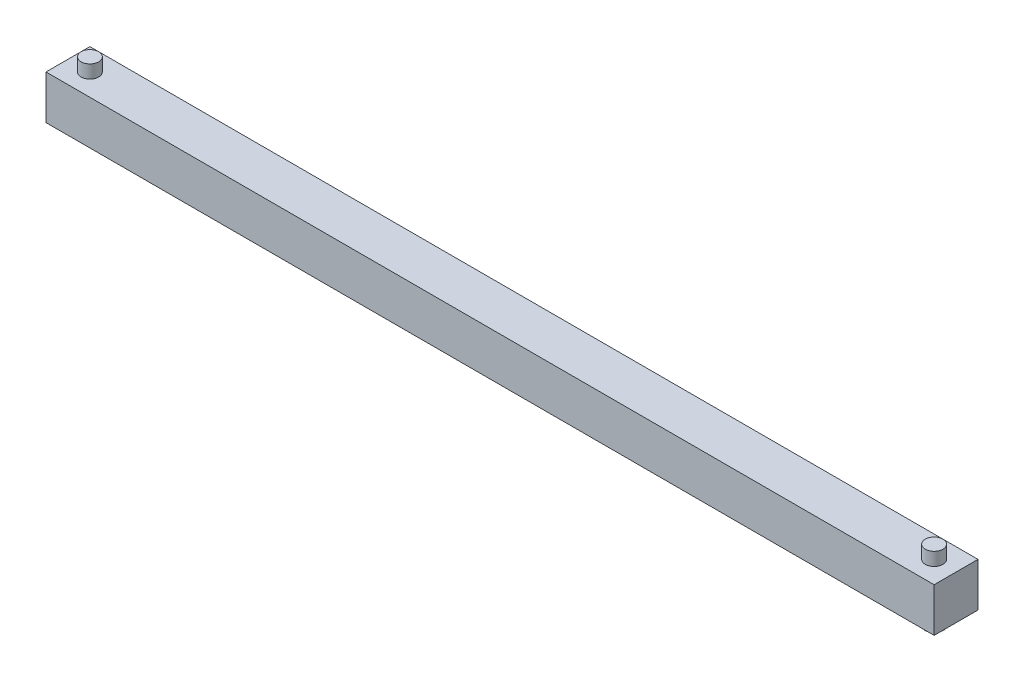
ISO-10303-21;
HEADER;
FILE_DESCRIPTION(('STEP AP214'),'2;1');
FILE_NAME('part.step','',(''),(''),'','','');
FILE_SCHEMA(('AUTOMOTIVE_DESIGN { 1 0 10303 214 1 1 1 1 }'));
ENDSEC;
DATA;
#1=APPLICATION_CONTEXT('core data for automotive mechanical design processes');
#2=APPLICATION_PROTOCOL_DEFINITION('international standard','automotive_design',2000,#1);
#3=PRODUCT_CONTEXT('',#1,'mechanical');
#4=PRODUCT('Part','Part','',(#3));
#5=PRODUCT_RELATED_PRODUCT_CATEGORY('part','',(#4));
#6=PRODUCT_DEFINITION_FORMATION('','',#4);
#7=PRODUCT_DEFINITION_CONTEXT('part definition',#1,'design');
#8=PRODUCT_DEFINITION('design','',#6,#7);
#9=PRODUCT_DEFINITION_SHAPE('','',#8);
#10=(LENGTH_UNIT() NAMED_UNIT(*) SI_UNIT(.MILLI.,.METRE.));
#11=(NAMED_UNIT(*) PLANE_ANGLE_UNIT() SI_UNIT($,.RADIAN.));
#12=(NAMED_UNIT(*) SI_UNIT($,.STERADIAN.) SOLID_ANGLE_UNIT());
#13=UNCERTAINTY_MEASURE_WITH_UNIT(LENGTH_MEASURE(1.E-05),#10,'distance_accuracy_value','');
#14=(GEOMETRIC_REPRESENTATION_CONTEXT(3) GLOBAL_UNCERTAINTY_ASSIGNED_CONTEXT((#13)) GLOBAL_UNIT_ASSIGNED_CONTEXT((#10,
#11,#12)) REPRESENTATION_CONTEXT('',''));
#15=CARTESIAN_POINT('',(0.,0.,0.));
#16=DIRECTION('',(0.,0.,1.));
#17=DIRECTION('',(1.,0.,0.));
#18=AXIS2_PLACEMENT_3D('',#15,#16,#17);
#19=CARTESIAN_POINT('',(-96.5829836274042,0.,8.));
#20=DIRECTION('',(1.,0.,0.));
#21=DIRECTION('',(0.,0.,-1.));
#22=AXIS2_PLACEMENT_3D('',#19,#20,#21);
#23=PLANE('',#22);
#24=DIRECTION('',(0.,-1.,0.));
#25=VECTOR('',#24,1.);
#26=CARTESIAN_POINT('',(-96.5829836274042,0.,0.));
#27=LINE('',#26,#25);
#28=CARTESIAN_POINT('',(-96.5829836274042,-5.31358607534573,0.));
#29=VERTEX_POINT('',#28);
#30=CARTESIAN_POINT('',(-96.5829836274042,-13.3135860753457,0.));
#31=VERTEX_POINT('',#30);
#32=EDGE_CURVE('E113',#29,#31,#27,.T.);
#33=ORIENTED_EDGE('',*,*,#32,.T.);
#34=DIRECTION('',(0.,0.,-1.));
#35=VECTOR('',#34,1.);
#36=CARTESIAN_POINT('',(-96.5829836274042,-13.3135860753457,8.));
#37=LINE('',#36,#35);
#38=CARTESIAN_POINT('',(-96.5829836274042,-13.3135860753457,8.));
#39=VERTEX_POINT('',#38);
#40=EDGE_CURVE('E102',#39,#31,#37,.T.);
#41=ORIENTED_EDGE('',*,*,#40,.F.);
#42=DIRECTION('',(0.,-1.,0.));
#43=VECTOR('',#42,1.);
#44=CARTESIAN_POINT('',(-96.5829836274042,0.,8.));
#45=LINE('',#44,#43);
#46=CARTESIAN_POINT('',(-96.5829836274042,-5.31358607534573,8.));
#47=VERTEX_POINT('',#46);
#48=EDGE_CURVE('E94',#47,#39,#45,.T.);
#49=ORIENTED_EDGE('',*,*,#48,.F.);
#50=DIRECTION('',(0.,0.,-1.));
#51=VECTOR('',#50,1.);
#52=CARTESIAN_POINT('',(-96.5829836274042,-5.31358607534573,8.));
#53=LINE('',#52,#51);
#54=EDGE_CURVE('E109',#47,#29,#53,.T.);
#55=ORIENTED_EDGE('',*,*,#54,.T.);
#56=EDGE_LOOP('',(#33,#41,#49,#55));
#57=FACE_BOUND('',#56,.T.);
#58=ADVANCED_FACE('F41',(#57),#23,.F.);
#59=CARTESIAN_POINT('',(0.,-13.3135860753457,8.));
#60=DIRECTION('',(0.,1.,0.));
#61=DIRECTION('',(0.,0.,1.));
#62=AXIS2_PLACEMENT_3D('',#59,#60,#61);
#63=PLANE('',#62);
#64=CARTESIAN_POINT('',(61.2686643725958,-13.3135860753457,4.00000000000002));
#65=DIRECTION('',(0.,1.,0.));
#66=DIRECTION('',(0.,0.,1.));
#67=AXIS2_PLACEMENT_3D('',#64,#65,#66);
#68=CIRCLE('',#67,1.65000000000001);
#69=CARTESIAN_POINT('',(61.2686643725958,-13.3135860753457,5.65000000000003));
#70=VERTEX_POINT('',#69);
#71=EDGE_CURVE('E11',#70,#70,#68,.F.);
#72=ORIENTED_EDGE('',*,*,#71,.F.);
#73=EDGE_LOOP('',(#72));
#74=FACE_BOUND('',#73,.T.);
#75=CARTESIAN_POINT('',(-92.5829836274042,-13.3135860753457,4.));
#76=DIRECTION('',(0.,1.,0.));
#77=DIRECTION('',(0.,0.,1.));
#78=AXIS2_PLACEMENT_3D('',#75,#76,#77);
#79=CIRCLE('',#78,1.60000000000001);
#80=CARTESIAN_POINT('',(-92.5829836274042,-13.3135860753457,5.60000000000001));
#81=VERTEX_POINT('',#80);
#82=EDGE_CURVE('E50',#81,#81,#79,.F.);
#83=ORIENTED_EDGE('',*,*,#82,.F.);
#84=EDGE_LOOP('',(#83));
#85=FACE_BOUND('',#84,.T.);
#86=DIRECTION('',(1.,0.,0.));
#87=VECTOR('',#86,1.);
#88=CARTESIAN_POINT('',(0.,-13.3135860753457,0.));
#89=LINE('',#88,#87);
#90=CARTESIAN_POINT('',(65.2686643725958,-13.3135860753457,0.));
#91=VERTEX_POINT('',#90);
#92=EDGE_CURVE('E100',#31,#91,#89,.T.);
#93=ORIENTED_EDGE('',*,*,#92,.T.);
#94=DIRECTION('',(0.,0.,-1.));
#95=VECTOR('',#94,1.);
#96=CARTESIAN_POINT('',(65.2686643725958,-13.3135860753457,8.));
#97=LINE('',#96,#95);
#98=CARTESIAN_POINT('',(65.2686643725958,-13.3135860753457,8.));
#99=VERTEX_POINT('',#98);
#100=EDGE_CURVE('E98',#99,#91,#97,.T.);
#101=ORIENTED_EDGE('',*,*,#100,.F.);
#102=DIRECTION('',(1.,0.,0.));
#103=VECTOR('',#102,1.);
#104=CARTESIAN_POINT('',(0.,-13.3135860753457,8.));
#105=LINE('',#104,#103);
#106=EDGE_CURVE('E89',#39,#99,#105,.T.);
#107=ORIENTED_EDGE('',*,*,#106,.F.);
#108=ORIENTED_EDGE('',*,*,#40,.T.);
#109=EDGE_LOOP('',(#93,#101,#107,#108));
#110=FACE_BOUND('',#109,.T.);
#111=ADVANCED_FACE('F99',(#74,#85,#110),#63,.F.);
#112=CARTESIAN_POINT('',(65.2686643725958,0.,8.));
#113=DIRECTION('',(-1.,0.,0.));
#114=DIRECTION('',(0.,0.,1.));
#115=AXIS2_PLACEMENT_3D('',#112,#113,#114);
#116=PLANE('',#115);
#117=DIRECTION('',(0.,1.,0.));
#118=VECTOR('',#117,1.);
#119=CARTESIAN_POINT('',(65.2686643725958,0.,0.));
#120=LINE('',#119,#118);
#121=CARTESIAN_POINT('',(65.2686643725958,-5.31358607534573,0.));
#122=VERTEX_POINT('',#121);
#123=EDGE_CURVE('E75',#91,#122,#120,.T.);
#124=ORIENTED_EDGE('',*,*,#123,.T.);
#125=DIRECTION('',(0.,0.,-1.));
#126=VECTOR('',#125,1.);
#127=CARTESIAN_POINT('',(65.2686643725958,-5.31358607534573,8.));
#128=LINE('',#127,#126);
#129=CARTESIAN_POINT('',(65.2686643725958,-5.31358607534573,8.));
#130=VERTEX_POINT('',#129);
#131=EDGE_CURVE('E103',#130,#122,#128,.T.);
#132=ORIENTED_EDGE('',*,*,#131,.F.);
#133=DIRECTION('',(0.,1.,0.));
#134=VECTOR('',#133,1.);
#135=CARTESIAN_POINT('',(65.2686643725958,0.,8.));
#136=LINE('',#135,#134);
#137=EDGE_CURVE('E92',#99,#130,#136,.T.);
#138=ORIENTED_EDGE('',*,*,#137,.F.);
#139=ORIENTED_EDGE('',*,*,#100,.T.);
#140=EDGE_LOOP('',(#124,#132,#138,#139));
#141=FACE_BOUND('',#140,.T.);
#142=ADVANCED_FACE('F105',(#141),#116,.F.);
#143=CARTESIAN_POINT('',(0.,-5.31358607534571,8.));
#144=DIRECTION('',(0.,-1.,0.));
#145=DIRECTION('',(1.,0.,0.));
#146=AXIS2_PLACEMENT_3D('',#143,#144,#145);
#147=PLANE('',#146);
#148=CARTESIAN_POINT('',(61.2686643725958,-5.3135860753457,4.00000000000002));
#149=DIRECTION('',(0.,-1.,0.));
#150=DIRECTION('',(1.,0.,0.));
#151=AXIS2_PLACEMENT_3D('',#148,#149,#150);
#152=CIRCLE('',#151,1.59999999999999);
#153=CARTESIAN_POINT('',(62.8686643725958,-5.3135860753457,4.00000000000002));
#154=VERTEX_POINT('',#153);
#155=EDGE_CURVE('E134',#154,#154,#152,.F.);
#156=ORIENTED_EDGE('',*,*,#155,.F.);
#157=EDGE_LOOP('',(#156));
#158=FACE_BOUND('',#157,.T.);
#159=CARTESIAN_POINT('',(-92.5829836274042,-5.31358607534573,4.));
#160=DIRECTION('',(0.,-1.,0.));
#161=DIRECTION('',(1.,0.,0.));
#162=AXIS2_PLACEMENT_3D('',#159,#160,#161);
#163=CIRCLE('',#162,1.60000000000001);
#164=CARTESIAN_POINT('',(-90.9829836274042,-5.31358607534573,4.));
#165=VERTEX_POINT('',#164);
#166=EDGE_CURVE('E130',#165,#165,#163,.F.);
#167=ORIENTED_EDGE('',*,*,#166,.F.);
#168=EDGE_LOOP('',(#167));
#169=FACE_BOUND('',#168,.T.);
#170=DIRECTION('',(-1.,0.,0.));
#171=VECTOR('',#170,1.);
#172=CARTESIAN_POINT('',(0.,-5.31358607534571,0.));
#173=LINE('',#172,#171);
#174=EDGE_CURVE('E81',#122,#29,#173,.T.);
#175=ORIENTED_EDGE('',*,*,#174,.T.);
#176=ORIENTED_EDGE('',*,*,#54,.F.);
#177=DIRECTION('',(-1.,0.,0.));
#178=VECTOR('',#177,1.);
#179=CARTESIAN_POINT('',(0.,-5.31358607534571,8.));
#180=LINE('',#179,#178);
#181=EDGE_CURVE('E58',#130,#47,#180,.T.);
#182=ORIENTED_EDGE('',*,*,#181,.F.);
#183=ORIENTED_EDGE('',*,*,#131,.T.);
#184=EDGE_LOOP('',(#175,#176,#182,#183));
#185=FACE_BOUND('',#184,.T.);
#186=ADVANCED_FACE('F149',(#158,#169,#185),#147,.F.);
#187=CARTESIAN_POINT('',(0.,0.,8.));
#188=DIRECTION('',(0.,0.,1.));
#189=DIRECTION('',(1.,0.,0.));
#190=AXIS2_PLACEMENT_3D('',#187,#188,#189);
#191=PLANE('',#190);
#192=ORIENTED_EDGE('',*,*,#48,.T.);
#193=ORIENTED_EDGE('',*,*,#106,.T.);
#194=ORIENTED_EDGE('',*,*,#137,.T.);
#195=ORIENTED_EDGE('',*,*,#181,.T.);
#196=EDGE_LOOP('',(#192,#193,#194,#195));
#197=FACE_BOUND('',#196,.T.);
#198=ADVANCED_FACE('F90',(#197),#191,.T.);
#199=CARTESIAN_POINT('',(0.,0.,0.));
#200=DIRECTION('',(0.,0.,1.));
#201=DIRECTION('',(1.,0.,0.));
#202=AXIS2_PLACEMENT_3D('',#199,#200,#201);
#203=PLANE('',#202);
#204=ORIENTED_EDGE('',*,*,#32,.F.);
#205=ORIENTED_EDGE('',*,*,#174,.F.);
#206=ORIENTED_EDGE('',*,*,#123,.F.);
#207=ORIENTED_EDGE('',*,*,#92,.F.);
#208=EDGE_LOOP('',(#204,#205,#206,#207));
#209=FACE_BOUND('',#208,.T.);
#210=ADVANCED_FACE('F157',(#209),#203,.F.);
#211=CARTESIAN_POINT('',(-92.5829836274042,-2.91358607534573,4.));
#212=DIRECTION('',(0.,-1.,0.));
#213=DIRECTION('',(1.,0.,0.));
#214=AXIS2_PLACEMENT_3D('',#211,#212,#213);
#215=CYLINDRICAL_SURFACE('',#214,1.60000000000001);
#216=CARTESIAN_POINT('',(-92.5829836274042,-2.91358607534573,4.));
#217=DIRECTION('',(0.,1.,0.));
#218=DIRECTION('',(-1.,0.,0.));
#219=AXIS2_PLACEMENT_3D('',#216,#217,#218);
#220=CIRCLE('',#219,1.60000000000001);
#221=CARTESIAN_POINT('',(-94.1829836274042,-2.91358607534573,4.));
#222=VERTEX_POINT('',#221);
#223=EDGE_CURVE('E117',#222,#222,#220,.T.);
#224=ORIENTED_EDGE('',*,*,#223,.F.);
#225=EDGE_LOOP('',(#224));
#226=FACE_BOUND('',#225,.T.);
#227=ORIENTED_EDGE('',*,*,#166,.T.);
#228=EDGE_LOOP('',(#227));
#229=FACE_BOUND('',#228,.T.);
#230=ADVANCED_FACE('F160',(#226,#229),#215,.T.);
#231=CARTESIAN_POINT('',(0.,-2.91358607534571,0.));
#232=DIRECTION('',(0.,1.,0.));
#233=DIRECTION('',(-1.,0.,0.));
#234=AXIS2_PLACEMENT_3D('',#231,#232,#233);
#235=PLANE('',#234);
#236=ORIENTED_EDGE('',*,*,#223,.T.);
#237=EDGE_LOOP('',(#236));
#238=FACE_BOUND('',#237,.T.);
#239=ADVANCED_FACE('F166',(#238),#235,.T.);
#240=CARTESIAN_POINT('',(61.2686643725958,-2.9135860753457,4.00000000000002));
#241=DIRECTION('',(0.,-1.,0.));
#242=DIRECTION('',(1.,0.,0.));
#243=AXIS2_PLACEMENT_3D('',#240,#241,#242);
#244=CYLINDRICAL_SURFACE('',#243,1.59999999999999);
#245=CARTESIAN_POINT('',(61.2686643725958,-2.9135860753457,4.00000000000002));
#246=DIRECTION('',(0.,1.,0.));
#247=DIRECTION('',(-1.,0.,0.));
#248=AXIS2_PLACEMENT_3D('',#245,#246,#247);
#249=CIRCLE('',#248,1.59999999999999);
#250=CARTESIAN_POINT('',(59.6686643725958,-2.9135860753457,4.00000000000002));
#251=VERTEX_POINT('',#250);
#252=EDGE_CURVE('E203',#251,#251,#249,.T.);
#253=ORIENTED_EDGE('',*,*,#252,.F.);
#254=EDGE_LOOP('',(#253));
#255=FACE_BOUND('',#254,.T.);
#256=ORIENTED_EDGE('',*,*,#155,.T.);
#257=EDGE_LOOP('',(#256));
#258=FACE_BOUND('',#257,.T.);
#259=ADVANCED_FACE('F170',(#255,#258),#244,.T.);
#260=CARTESIAN_POINT('',(0.,-2.91358607534571,0.));
#261=DIRECTION('',(0.,1.,0.));
#262=DIRECTION('',(-1.,0.,0.));
#263=AXIS2_PLACEMENT_3D('',#260,#261,#262);
#264=PLANE('',#263);
#265=ORIENTED_EDGE('',*,*,#252,.T.);
#266=EDGE_LOOP('',(#265));
#267=FACE_BOUND('',#266,.T.);
#268=ADVANCED_FACE('F174',(#267),#264,.T.);
#269=CARTESIAN_POINT('',(-92.5829836274042,-15.7135860753457,4.));
#270=DIRECTION('',(0.,1.,0.));
#271=DIRECTION('',(0.,0.,1.));
#272=AXIS2_PLACEMENT_3D('',#269,#270,#271);
#273=CYLINDRICAL_SURFACE('',#272,1.60000000000001);
#274=CARTESIAN_POINT('',(-92.5829836274042,-15.7135860753457,4.));
#275=DIRECTION('',(0.,-1.,0.));
#276=DIRECTION('',(0.,0.,-1.));
#277=AXIS2_PLACEMENT_3D('',#274,#275,#276);
#278=CIRCLE('',#277,1.60000000000001);
#279=CARTESIAN_POINT('',(-92.5829836274042,-15.7135860753457,2.4));
#280=VERTEX_POINT('',#279);
#281=EDGE_CURVE('E199',#280,#280,#278,.T.);
#282=ORIENTED_EDGE('',*,*,#281,.F.);
#283=EDGE_LOOP('',(#282));
#284=FACE_BOUND('',#283,.T.);
#285=ORIENTED_EDGE('',*,*,#82,.T.);
#286=EDGE_LOOP('',(#285));
#287=FACE_BOUND('',#286,.T.);
#288=ADVANCED_FACE('F141',(#284,#287),#273,.T.);
#289=CARTESIAN_POINT('',(0.,-15.7135860753457,0.));
#290=DIRECTION('',(0.,-1.,0.));
#291=DIRECTION('',(0.,0.,-1.));
#292=AXIS2_PLACEMENT_3D('',#289,#290,#291);
#293=PLANE('',#292);
#294=ORIENTED_EDGE('',*,*,#281,.T.);
#295=EDGE_LOOP('',(#294));
#296=FACE_BOUND('',#295,.T.);
#297=ADVANCED_FACE('F181',(#296),#293,.T.);
#298=CARTESIAN_POINT('',(61.2686643725958,-15.7135860753457,4.00000000000002));
#299=DIRECTION('',(0.,1.,0.));
#300=DIRECTION('',(0.,0.,1.));
#301=AXIS2_PLACEMENT_3D('',#298,#299,#300);
#302=CYLINDRICAL_SURFACE('',#301,1.65000000000001);
#303=CARTESIAN_POINT('',(61.2686643725958,-15.7135860753457,4.00000000000002));
#304=DIRECTION('',(0.,-1.,0.));
#305=DIRECTION('',(0.,0.,-1.));
#306=AXIS2_PLACEMENT_3D('',#303,#304,#305);
#307=CIRCLE('',#306,1.65000000000001);
#308=CARTESIAN_POINT('',(61.2686643725958,-15.7135860753457,2.35000000000001));
#309=VERTEX_POINT('',#308);
#310=EDGE_CURVE('E197',#309,#309,#307,.T.);
#311=ORIENTED_EDGE('',*,*,#310,.F.);
#312=EDGE_LOOP('',(#311));
#313=FACE_BOUND('',#312,.T.);
#314=ORIENTED_EDGE('',*,*,#71,.T.);
#315=EDGE_LOOP('',(#314));
#316=FACE_BOUND('',#315,.T.);
#317=ADVANCED_FACE('F185',(#313,#316),#302,.T.);
#318=CARTESIAN_POINT('',(0.,-15.7135860753457,0.));
#319=DIRECTION('',(0.,-1.,0.));
#320=DIRECTION('',(0.,0.,-1.));
#321=AXIS2_PLACEMENT_3D('',#318,#319,#320);
#322=PLANE('',#321);
#323=ORIENTED_EDGE('',*,*,#310,.T.);
#324=EDGE_LOOP('',(#323));
#325=FACE_BOUND('',#324,.T.);
#326=ADVANCED_FACE('F189',(#325),#322,.T.);
#327=CLOSED_SHELL('',(#58,#111,#142,#186,#198,#210,#230,#239,#259,#268,#288,#297,#317,#326));
#328=MANIFOLD_SOLID_BREP('B2',#327);
#329=ADVANCED_BREP_SHAPE_REPRESENTATION('',(#18,#328),#14);
#330=SHAPE_DEFINITION_REPRESENTATION(#9,#329);
ENDSEC;
END-ISO-10303-21;
